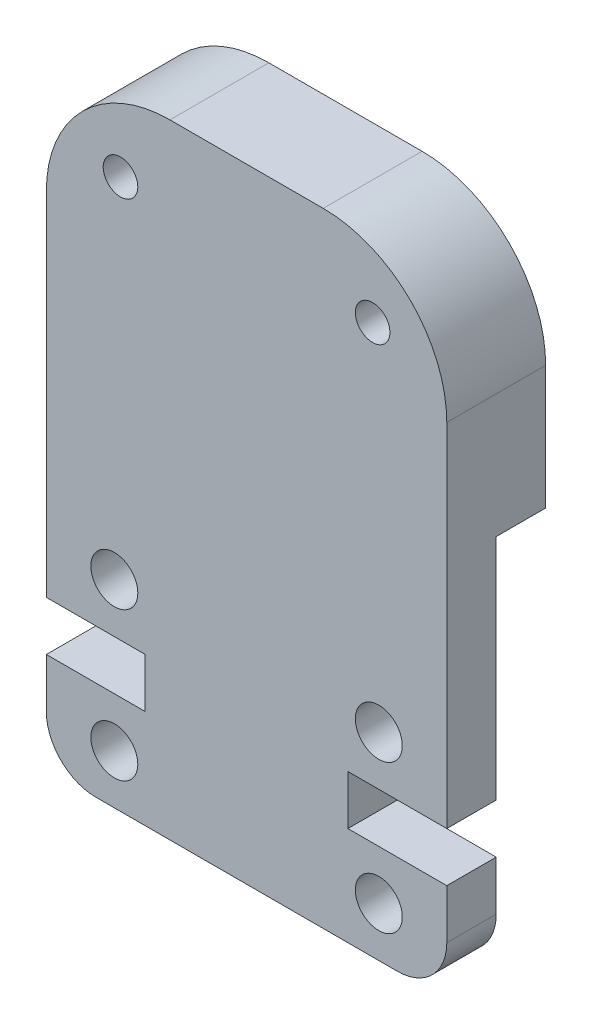
ISO-10303-21;
HEADER;
FILE_DESCRIPTION(('STEP AP214'),'2;1');
FILE_NAME('part.step','',(''),(''),'','','');
FILE_SCHEMA(('AUTOMOTIVE_DESIGN { 1 0 10303 214 1 1 1 1 }'));
ENDSEC;
DATA;
#1=APPLICATION_CONTEXT('core data for automotive mechanical design processes');
#2=APPLICATION_PROTOCOL_DEFINITION('international standard','automotive_design',2000,#1);
#3=PRODUCT_CONTEXT('',#1,'mechanical');
#4=PRODUCT('Part','Part','',(#3));
#5=PRODUCT_RELATED_PRODUCT_CATEGORY('part','',(#4));
#6=PRODUCT_DEFINITION_FORMATION('','',#4);
#7=PRODUCT_DEFINITION_CONTEXT('part definition',#1,'design');
#8=PRODUCT_DEFINITION('design','',#6,#7);
#9=PRODUCT_DEFINITION_SHAPE('','',#8);
#10=(LENGTH_UNIT() NAMED_UNIT(*) SI_UNIT(.MILLI.,.METRE.));
#11=(NAMED_UNIT(*) PLANE_ANGLE_UNIT() SI_UNIT($,.RADIAN.));
#12=(NAMED_UNIT(*) SI_UNIT($,.STERADIAN.) SOLID_ANGLE_UNIT());
#13=UNCERTAINTY_MEASURE_WITH_UNIT(LENGTH_MEASURE(1.E-05),#10,'distance_accuracy_value','');
#14=(GEOMETRIC_REPRESENTATION_CONTEXT(3) GLOBAL_UNCERTAINTY_ASSIGNED_CONTEXT((#13)) GLOBAL_UNIT_ASSIGNED_CONTEXT((#10,
#11,#12)) REPRESENTATION_CONTEXT('',''));
#15=CARTESIAN_POINT('',(0.,0.,0.));
#16=DIRECTION('',(0.,0.,1.));
#17=DIRECTION('',(1.,0.,0.));
#18=AXIS2_PLACEMENT_3D('',#15,#16,#17);
#19=CARTESIAN_POINT('',(14.2,2.00000000000002,0.));
#20=DIRECTION('',(0.,0.,-1.));
#21=DIRECTION('',(-1.,0.,0.));
#22=AXIS2_PLACEMENT_3D('',#19,#20,#21);
#23=PLANE('',#22);
#24=CARTESIAN_POINT('',(13.1999999999968,22.2299999999968,0.));
#25=DIRECTION('',(0.,0.,1.));
#26=DIRECTION('',(-1.,0.,0.));
#27=AXIS2_PLACEMENT_3D('',#24,#25,#26);
#28=CIRCLE('',#27,0.699999999999999);
#29=CARTESIAN_POINT('',(12.4999999999968,22.2299999999968,0.));
#30=VERTEX_POINT('',#29);
#31=EDGE_CURVE('E282',#30,#30,#28,.T.);
#32=ORIENTED_EDGE('',*,*,#31,.T.);
#33=EDGE_LOOP('',(#32));
#34=FACE_BOUND('',#33,.T.);
#35=CARTESIAN_POINT('',(3.00000000000323,22.2299999999968,0.));
#36=DIRECTION('',(0.,0.,1.));
#37=DIRECTION('',(1.,0.,0.));
#38=AXIS2_PLACEMENT_3D('',#35,#36,#37);
#39=CIRCLE('',#38,0.699999999999998);
#40=CARTESIAN_POINT('',(3.70000000000323,22.2299999999968,0.));
#41=VERTEX_POINT('',#40);
#42=EDGE_CURVE('E270',#41,#41,#39,.T.);
#43=ORIENTED_EDGE('',*,*,#42,.T.);
#44=EDGE_LOOP('',(#43));
#45=FACE_BOUND('',#44,.T.);
#46=DIRECTION('',(0.,1.,0.));
#47=VECTOR('',#46,1.);
#48=CARTESIAN_POINT('',(16.2,20.23,0.));
#49=LINE('',#48,#47);
#50=CARTESIAN_POINT('',(16.2,15.23,0.));
#51=VERTEX_POINT('',#50);
#52=CARTESIAN_POINT('',(16.2,20.23,0.));
#53=VERTEX_POINT('',#52);
#54=EDGE_CURVE('E159',#51,#53,#49,.T.);
#55=ORIENTED_EDGE('',*,*,#54,.F.);
#56=DIRECTION('',(-1.,0.,0.));
#57=VECTOR('',#56,1.);
#58=CARTESIAN_POINT('',(16.2,15.23,0.));
#59=LINE('',#58,#57);
#60=CARTESIAN_POINT('',(0.,15.23,0.));
#61=VERTEX_POINT('',#60);
#62=EDGE_CURVE('E231',#51,#61,#59,.T.);
#63=ORIENTED_EDGE('',*,*,#62,.T.);
#64=DIRECTION('',(0.,-1.,0.));
#65=VECTOR('',#64,1.);
#66=CARTESIAN_POINT('',(0.,20.23,0.));
#67=LINE('',#66,#65);
#68=CARTESIAN_POINT('',(0.,20.23,0.));
#69=VERTEX_POINT('',#68);
#70=EDGE_CURVE('E167',#69,#61,#67,.T.);
#71=ORIENTED_EDGE('',*,*,#70,.F.);
#72=CARTESIAN_POINT('',(5.00000000000002,20.23,0.));
#73=DIRECTION('',(0.,0.,1.));
#74=DIRECTION('',(1.,0.,0.));
#75=AXIS2_PLACEMENT_3D('',#72,#73,#74);
#76=CIRCLE('',#75,5.00000000000002);
#77=CARTESIAN_POINT('',(5.00000000000002,25.23,0.));
#78=VERTEX_POINT('',#77);
#79=EDGE_CURVE('E80',#78,#69,#76,.T.);
#80=ORIENTED_EDGE('',*,*,#79,.F.);
#81=DIRECTION('',(-1.,0.,0.));
#82=VECTOR('',#81,1.);
#83=CARTESIAN_POINT('',(5.00000000000002,25.23,0.));
#84=LINE('',#83,#82);
#85=CARTESIAN_POINT('',(11.2,25.23,0.));
#86=VERTEX_POINT('',#85);
#87=EDGE_CURVE('E164',#86,#78,#84,.T.);
#88=ORIENTED_EDGE('',*,*,#87,.F.);
#89=CARTESIAN_POINT('',(11.2,20.23,0.));
#90=DIRECTION('',(0.,0.,1.));
#91=DIRECTION('',(-1.,0.,0.));
#92=AXIS2_PLACEMENT_3D('',#89,#90,#91);
#93=CIRCLE('',#92,5.00000000000002);
#94=EDGE_CURVE('E161',#53,#86,#93,.T.);
#95=ORIENTED_EDGE('',*,*,#94,.F.);
#96=EDGE_LOOP('',(#55,#63,#71,#80,#88,#95));
#97=FACE_BOUND('',#96,.T.);
#98=ADVANCED_FACE('F33',(#34,#45,#97),#23,.T.);
#99=CARTESIAN_POINT('',(16.2,20.23,4.));
#100=DIRECTION('',(-1.,0.,0.));
#101=DIRECTION('',(0.,-1.,0.));
#102=AXIS2_PLACEMENT_3D('',#99,#100,#101);
#103=PLANE('',#102);
#104=DIRECTION('',(0.,0.,-1.));
#105=VECTOR('',#104,1.);
#106=CARTESIAN_POINT('',(16.2,15.23,2.));
#107=LINE('',#106,#105);
#108=CARTESIAN_POINT('',(16.2,15.23,2.));
#109=VERTEX_POINT('',#108);
#110=EDGE_CURVE('E236',#109,#51,#107,.T.);
#111=ORIENTED_EDGE('',*,*,#110,.T.);
#112=ORIENTED_EDGE('',*,*,#54,.T.);
#113=DIRECTION('',(0.,0.,-1.));
#114=VECTOR('',#113,1.);
#115=CARTESIAN_POINT('',(16.2,20.23,4.));
#116=LINE('',#115,#114);
#117=CARTESIAN_POINT('',(16.2,20.23,4.));
#118=VERTEX_POINT('',#117);
#119=EDGE_CURVE('E191',#118,#53,#116,.T.);
#120=ORIENTED_EDGE('',*,*,#119,.F.);
#121=DIRECTION('',(0.,1.,0.));
#122=VECTOR('',#121,1.);
#123=CARTESIAN_POINT('',(16.2,20.23,4.));
#124=LINE('',#123,#122);
#125=CARTESIAN_POINT('',(16.2,6.00000000000006,4.));
#126=VERTEX_POINT('',#125);
#127=EDGE_CURVE('E297',#126,#118,#124,.T.);
#128=ORIENTED_EDGE('',*,*,#127,.F.);
#129=DIRECTION('',(0.,0.,-1.));
#130=VECTOR('',#129,1.);
#131=CARTESIAN_POINT('',(16.2,6.00000000000006,4.));
#132=LINE('',#131,#130);
#133=CARTESIAN_POINT('',(16.2,6.00000000000006,2.));
#134=VERTEX_POINT('',#133);
#135=EDGE_CURVE('E194',#126,#134,#132,.T.);
#136=ORIENTED_EDGE('',*,*,#135,.T.);
#137=DIRECTION('',(0.,1.,0.));
#138=VECTOR('',#137,1.);
#139=CARTESIAN_POINT('',(16.2,0.,2.));
#140=LINE('',#139,#138);
#141=EDGE_CURVE('E221',#134,#109,#140,.T.);
#142=ORIENTED_EDGE('',*,*,#141,.T.);
#143=EDGE_LOOP('',(#111,#112,#120,#128,#136,#142));
#144=FACE_BOUND('',#143,.T.);
#145=ADVANCED_FACE('F379',(#144),#103,.F.);
#146=CARTESIAN_POINT('',(0.,20.23,4.));
#147=DIRECTION('',(1.,0.,0.));
#148=DIRECTION('',(0.,1.,0.));
#149=AXIS2_PLACEMENT_3D('',#146,#147,#148);
#150=PLANE('',#149);
#151=DIRECTION('',(0.,0.,-1.));
#152=VECTOR('',#151,1.);
#153=CARTESIAN_POINT('',(0.,15.23,2.));
#154=LINE('',#153,#152);
#155=CARTESIAN_POINT('',(0.,15.23,2.));
#156=VERTEX_POINT('',#155);
#157=EDGE_CURVE('E224',#156,#61,#154,.T.);
#158=ORIENTED_EDGE('',*,*,#157,.F.);
#159=DIRECTION('',(0.,-1.,0.));
#160=VECTOR('',#159,1.);
#161=CARTESIAN_POINT('',(0.,15.23,2.));
#162=LINE('',#161,#160);
#163=CARTESIAN_POINT('',(0.,6.00000000000004,2.));
#164=VERTEX_POINT('',#163);
#165=EDGE_CURVE('E356',#156,#164,#162,.T.);
#166=ORIENTED_EDGE('',*,*,#165,.T.);
#167=DIRECTION('',(0.,0.,-1.));
#168=VECTOR('',#167,1.);
#169=CARTESIAN_POINT('',(0.,6.00000000000003,4.));
#170=LINE('',#169,#168);
#171=CARTESIAN_POINT('',(0.,6.00000000000003,4.));
#172=VERTEX_POINT('',#171);
#173=EDGE_CURVE('E181',#172,#164,#170,.T.);
#174=ORIENTED_EDGE('',*,*,#173,.F.);
#175=DIRECTION('',(0.,-1.,0.));
#176=VECTOR('',#175,1.);
#177=CARTESIAN_POINT('',(0.,20.23,4.));
#178=LINE('',#177,#176);
#179=CARTESIAN_POINT('',(0.,20.23,4.));
#180=VERTEX_POINT('',#179);
#181=EDGE_CURVE('E305',#180,#172,#178,.T.);
#182=ORIENTED_EDGE('',*,*,#181,.F.);
#183=DIRECTION('',(0.,0.,-1.));
#184=VECTOR('',#183,1.);
#185=CARTESIAN_POINT('',(0.,20.23,4.));
#186=LINE('',#185,#184);
#187=EDGE_CURVE('E184',#180,#69,#186,.T.);
#188=ORIENTED_EDGE('',*,*,#187,.T.);
#189=ORIENTED_EDGE('',*,*,#70,.T.);
#190=EDGE_LOOP('',(#158,#166,#174,#182,#188,#189));
#191=FACE_BOUND('',#190,.T.);
#192=ADVANCED_FACE('F362',(#191),#150,.F.);
#193=CARTESIAN_POINT('',(14.2,2.00000000000002,4.));
#194=DIRECTION('',(0.,0.,-1.));
#195=DIRECTION('',(-1.,0.,0.));
#196=AXIS2_PLACEMENT_3D('',#193,#194,#195);
#197=PLANE('',#196);
#198=CARTESIAN_POINT('',(3.00000000000323,22.2299999999968,4.));
#199=DIRECTION('',(0.,0.,1.));
#200=DIRECTION('',(1.,0.,0.));
#201=AXIS2_PLACEMENT_3D('',#198,#199,#200);
#202=CIRCLE('',#201,0.699999999999998);
#203=CARTESIAN_POINT('',(3.70000000000323,22.2299999999968,4.));
#204=VERTEX_POINT('',#203);
#205=EDGE_CURVE('E271',#204,#204,#202,.T.);
#206=ORIENTED_EDGE('',*,*,#205,.F.);
#207=EDGE_LOOP('',(#206));
#208=FACE_BOUND('',#207,.T.);
#209=CARTESIAN_POINT('',(2.75000000000002,8.00000000000025,4.));
#210=DIRECTION('',(0.,0.,1.));
#211=DIRECTION('',(1.,0.,0.));
#212=AXIS2_PLACEMENT_3D('',#209,#210,#211);
#213=CIRCLE('',#212,0.95);
#214=CARTESIAN_POINT('',(3.70000000000002,8.00000000000025,4.));
#215=VERTEX_POINT('',#214);
#216=EDGE_CURVE('E279',#215,#215,#213,.T.);
#217=ORIENTED_EDGE('',*,*,#216,.F.);
#218=EDGE_LOOP('',(#217));
#219=FACE_BOUND('',#218,.T.);
#220=CARTESIAN_POINT('',(13.45,2.00000000000002,4.));
#221=DIRECTION('',(0.,0.,1.));
#222=DIRECTION('',(-1.,0.,0.));
#223=AXIS2_PLACEMENT_3D('',#220,#221,#222);
#224=CIRCLE('',#223,0.949999999999999);
#225=CARTESIAN_POINT('',(12.5,2.00000000000002,4.));
#226=VERTEX_POINT('',#225);
#227=EDGE_CURVE('E162',#226,#226,#224,.T.);
#228=ORIENTED_EDGE('',*,*,#227,.F.);
#229=EDGE_LOOP('',(#228));
#230=FACE_BOUND('',#229,.T.);
#231=CARTESIAN_POINT('',(14.2,2.00000000000002,4.));
#232=DIRECTION('',(0.,0.,1.));
#233=DIRECTION('',(-1.,0.,0.));
#234=AXIS2_PLACEMENT_3D('',#231,#232,#233);
#235=CIRCLE('',#234,2.00000000000002);
#236=CARTESIAN_POINT('',(14.2,0.,4.));
#237=VERTEX_POINT('',#236);
#238=CARTESIAN_POINT('',(16.2,2.00000000000002,4.));
#239=VERTEX_POINT('',#238);
#240=EDGE_CURVE('E170',#237,#239,#235,.T.);
#241=ORIENTED_EDGE('',*,*,#240,.T.);
#242=DIRECTION('',(0.,1.,0.));
#243=VECTOR('',#242,1.);
#244=CARTESIAN_POINT('',(16.2,2.00000000000002,4.));
#245=LINE('',#244,#243);
#246=CARTESIAN_POINT('',(16.2,4.00000000000001,4.));
#247=VERTEX_POINT('',#246);
#248=EDGE_CURVE('E88',#239,#247,#245,.T.);
#249=ORIENTED_EDGE('',*,*,#248,.T.);
#250=DIRECTION('',(-1.,0.,0.));
#251=VECTOR('',#250,1.);
#252=CARTESIAN_POINT('',(12.1999999999999,4.00000000000003,4.));
#253=LINE('',#252,#251);
#254=CARTESIAN_POINT('',(12.1999999999999,4.00000000000003,4.));
#255=VERTEX_POINT('',#254);
#256=EDGE_CURVE('E212',#247,#255,#253,.T.);
#257=ORIENTED_EDGE('',*,*,#256,.T.);
#258=DIRECTION('',(0.,1.,0.));
#259=VECTOR('',#258,1.);
#260=CARTESIAN_POINT('',(12.1999999999999,6.00000000000006,4.));
#261=LINE('',#260,#259);
#262=CARTESIAN_POINT('',(12.1999999999999,6.00000000000006,4.));
#263=VERTEX_POINT('',#262);
#264=EDGE_CURVE('E293',#255,#263,#261,.T.);
#265=ORIENTED_EDGE('',*,*,#264,.T.);
#266=DIRECTION('',(1.,0.,0.));
#267=VECTOR('',#266,1.);
#268=CARTESIAN_POINT('',(16.2,6.00000000000006,4.));
#269=LINE('',#268,#267);
#270=EDGE_CURVE('E295',#263,#126,#269,.T.);
#271=ORIENTED_EDGE('',*,*,#270,.T.);
#272=ORIENTED_EDGE('',*,*,#127,.T.);
#273=CARTESIAN_POINT('',(11.2,20.23,4.));
#274=DIRECTION('',(0.,0.,1.));
#275=DIRECTION('',(-1.,0.,0.));
#276=AXIS2_PLACEMENT_3D('',#273,#274,#275);
#277=CIRCLE('',#276,5.00000000000002);
#278=CARTESIAN_POINT('',(11.2,25.23,4.));
#279=VERTEX_POINT('',#278);
#280=EDGE_CURVE('E299',#118,#279,#277,.T.);
#281=ORIENTED_EDGE('',*,*,#280,.T.);
#282=DIRECTION('',(-1.,0.,0.));
#283=VECTOR('',#282,1.);
#284=CARTESIAN_POINT('',(5.00000000000002,25.23,4.));
#285=LINE('',#284,#283);
#286=CARTESIAN_POINT('',(5.00000000000002,25.23,4.));
#287=VERTEX_POINT('',#286);
#288=EDGE_CURVE('E301',#279,#287,#285,.T.);
#289=ORIENTED_EDGE('',*,*,#288,.T.);
#290=CARTESIAN_POINT('',(5.00000000000002,20.23,4.));
#291=DIRECTION('',(0.,0.,1.));
#292=DIRECTION('',(1.,0.,0.));
#293=AXIS2_PLACEMENT_3D('',#290,#291,#292);
#294=CIRCLE('',#293,5.00000000000002);
#295=EDGE_CURVE('E303',#287,#180,#294,.T.);
#296=ORIENTED_EDGE('',*,*,#295,.T.);
#297=ORIENTED_EDGE('',*,*,#181,.T.);
#298=DIRECTION('',(1.,0.,0.));
#299=VECTOR('',#298,1.);
#300=CARTESIAN_POINT('',(0.,6.00000000000003,4.));
#301=LINE('',#300,#299);
#302=CARTESIAN_POINT('',(4.00000000000004,6.00000000000003,4.));
#303=VERTEX_POINT('',#302);
#304=EDGE_CURVE('E307',#172,#303,#301,.T.);
#305=ORIENTED_EDGE('',*,*,#304,.T.);
#306=DIRECTION('',(0.,-1.,0.));
#307=VECTOR('',#306,1.);
#308=CARTESIAN_POINT('',(4.00000000000004,6.00000000000003,4.));
#309=LINE('',#308,#307);
#310=CARTESIAN_POINT('',(4.00000000000004,4.00000000000002,4.));
#311=VERTEX_POINT('',#310);
#312=EDGE_CURVE('E309',#303,#311,#309,.T.);
#313=ORIENTED_EDGE('',*,*,#312,.T.);
#314=DIRECTION('',(-1.,0.,0.));
#315=VECTOR('',#314,1.);
#316=CARTESIAN_POINT('',(4.00000000000004,4.00000000000002,4.));
#317=LINE('',#316,#315);
#318=CARTESIAN_POINT('',(0.,4.,4.));
#319=VERTEX_POINT('',#318);
#320=EDGE_CURVE('E135',#311,#319,#317,.T.);
#321=ORIENTED_EDGE('',*,*,#320,.T.);
#322=DIRECTION('',(0.,-1.,0.));
#323=VECTOR('',#322,1.);
#324=CARTESIAN_POINT('',(0.,2.00000000000003,4.));
#325=LINE('',#324,#323);
#326=CARTESIAN_POINT('',(0.,2.00000000000003,4.));
#327=VERTEX_POINT('',#326);
#328=EDGE_CURVE('E127',#319,#327,#325,.T.);
#329=ORIENTED_EDGE('',*,*,#328,.T.);
#330=CARTESIAN_POINT('',(2.00000000000001,2.00000000000003,4.));
#331=DIRECTION('',(0.,0.,1.));
#332=DIRECTION('',(1.,0.,0.));
#333=AXIS2_PLACEMENT_3D('',#330,#331,#332);
#334=CIRCLE('',#333,2.00000000000001);
#335=CARTESIAN_POINT('',(2.00000000000001,0.,4.));
#336=VERTEX_POINT('',#335);
#337=EDGE_CURVE('E132',#327,#336,#334,.T.);
#338=ORIENTED_EDGE('',*,*,#337,.T.);
#339=DIRECTION('',(1.,0.,0.));
#340=VECTOR('',#339,1.);
#341=CARTESIAN_POINT('',(2.00000000000001,0.,4.));
#342=LINE('',#341,#340);
#343=EDGE_CURVE('E58',#336,#237,#342,.T.);
#344=ORIENTED_EDGE('',*,*,#343,.T.);
#345=EDGE_LOOP('',(#241,#249,#257,#265,#271,#272,#281,#289,#296,#297,#305,#313,#321,#329,#338,#344));
#346=FACE_BOUND('',#345,.T.);
#347=CARTESIAN_POINT('',(13.1999999999968,22.2299999999968,4.));
#348=DIRECTION('',(0.,0.,1.));
#349=DIRECTION('',(-1.,0.,0.));
#350=AXIS2_PLACEMENT_3D('',#347,#348,#349);
#351=CIRCLE('',#350,0.699999999999999);
#352=CARTESIAN_POINT('',(12.4999999999968,22.2299999999968,4.));
#353=VERTEX_POINT('',#352);
#354=EDGE_CURVE('E283',#353,#353,#351,.T.);
#355=ORIENTED_EDGE('',*,*,#354,.F.);
#356=EDGE_LOOP('',(#355));
#357=FACE_BOUND('',#356,.T.);
#358=CARTESIAN_POINT('',(13.45,8.00000000000002,4.));
#359=DIRECTION('',(0.,0.,1.));
#360=DIRECTION('',(-1.,0.,0.));
#361=AXIS2_PLACEMENT_3D('',#358,#359,#360);
#362=CIRCLE('',#361,0.949999999999999);
#363=CARTESIAN_POINT('',(12.5,8.00000000000002,4.));
#364=VERTEX_POINT('',#363);
#365=EDGE_CURVE('E274',#364,#364,#362,.T.);
#366=ORIENTED_EDGE('',*,*,#365,.F.);
#367=EDGE_LOOP('',(#366));
#368=FACE_BOUND('',#367,.T.);
#369=CARTESIAN_POINT('',(2.75000000000002,2.00000000000025,4.));
#370=DIRECTION('',(0.,0.,1.));
#371=DIRECTION('',(1.,0.,0.));
#372=AXIS2_PLACEMENT_3D('',#369,#370,#371);
#373=CIRCLE('',#372,0.95);
#374=CARTESIAN_POINT('',(3.70000000000002,2.00000000000025,4.));
#375=VERTEX_POINT('',#374);
#376=EDGE_CURVE('E267',#375,#375,#373,.T.);
#377=ORIENTED_EDGE('',*,*,#376,.F.);
#378=EDGE_LOOP('',(#377));
#379=FACE_BOUND('',#378,.T.);
#380=ADVANCED_FACE('F129',(#208,#219,#230,#346,#357,#368,#379),#197,.F.);
#381=CARTESIAN_POINT('',(14.2,2.00000000000002,4.));
#382=DIRECTION('',(0.,0.,-1.));
#383=DIRECTION('',(-1.,0.,0.));
#384=AXIS2_PLACEMENT_3D('',#381,#382,#383);
#385=CYLINDRICAL_SURFACE('',#384,2.00000000000002);
#386=DIRECTION('',(0.,0.,-1.));
#387=VECTOR('',#386,1.);
#388=CARTESIAN_POINT('',(14.2,0.,4.));
#389=LINE('',#388,#387);
#390=CARTESIAN_POINT('',(14.2,0.,2.));
#391=VERTEX_POINT('',#390);
#392=EDGE_CURVE('E155',#237,#391,#389,.T.);
#393=ORIENTED_EDGE('',*,*,#392,.T.);
#394=CARTESIAN_POINT('',(14.2,2.00000000000002,2.));
#395=DIRECTION('',(0.,0.,1.));
#396=DIRECTION('',(1.,0.,0.));
#397=AXIS2_PLACEMENT_3D('',#394,#395,#396);
#398=CIRCLE('',#397,2.00000000000002);
#399=CARTESIAN_POINT('',(16.2,2.00000000000002,2.));
#400=VERTEX_POINT('',#399);
#401=EDGE_CURVE('E49',#391,#400,#398,.T.);
#402=ORIENTED_EDGE('',*,*,#401,.T.);
#403=DIRECTION('',(0.,0.,-1.));
#404=VECTOR('',#403,1.);
#405=CARTESIAN_POINT('',(16.2,2.00000000000002,4.));
#406=LINE('',#405,#404);
#407=EDGE_CURVE('E11',#239,#400,#406,.T.);
#408=ORIENTED_EDGE('',*,*,#407,.F.);
#409=ORIENTED_EDGE('',*,*,#240,.F.);
#410=EDGE_LOOP('',(#393,#402,#408,#409));
#411=FACE_BOUND('',#410,.T.);
#412=ADVANCED_FACE('F35',(#411),#385,.T.);
#413=CARTESIAN_POINT('',(16.2,2.00000000000002,4.));
#414=DIRECTION('',(-1.,0.,0.));
#415=DIRECTION('',(0.,-1.,0.));
#416=AXIS2_PLACEMENT_3D('',#413,#414,#415);
#417=PLANE('',#416);
#418=ORIENTED_EDGE('',*,*,#407,.T.);
#419=CARTESIAN_POINT('',(16.2,4.00000000000002,2.));
#420=VERTEX_POINT('',#419);
#421=EDGE_CURVE('E218',#400,#420,#140,.T.);
#422=ORIENTED_EDGE('',*,*,#421,.T.);
#423=DIRECTION('',(0.,0.,-1.));
#424=VECTOR('',#423,1.);
#425=CARTESIAN_POINT('',(16.2,4.00000000000001,4.));
#426=LINE('',#425,#424);
#427=EDGE_CURVE('E42',#247,#420,#426,.T.);
#428=ORIENTED_EDGE('',*,*,#427,.F.);
#429=ORIENTED_EDGE('',*,*,#248,.F.);
#430=EDGE_LOOP('',(#418,#422,#428,#429));
#431=FACE_BOUND('',#430,.T.);
#432=ADVANCED_FACE('F217',(#431),#417,.F.);
#433=CARTESIAN_POINT('',(12.1999999999999,4.00000000000003,4.));
#434=DIRECTION('',(0.,-1.,0.));
#435=DIRECTION('',(1.,0.,0.));
#436=AXIS2_PLACEMENT_3D('',#433,#434,#435);
#437=PLANE('',#436);
#438=ORIENTED_EDGE('',*,*,#427,.T.);
#439=DIRECTION('',(-1.,0.,0.));
#440=VECTOR('',#439,1.);
#441=CARTESIAN_POINT('',(12.1999999999999,4.00000000000003,2.));
#442=LINE('',#441,#440);
#443=CARTESIAN_POINT('',(12.1999999999999,4.00000000000003,2.));
#444=VERTEX_POINT('',#443);
#445=EDGE_CURVE('E211',#420,#444,#442,.T.);
#446=ORIENTED_EDGE('',*,*,#445,.T.);
#447=DIRECTION('',(0.,0.,-1.));
#448=VECTOR('',#447,1.);
#449=CARTESIAN_POINT('',(12.1999999999999,4.00000000000003,4.));
#450=LINE('',#449,#448);
#451=EDGE_CURVE('E200',#255,#444,#450,.T.);
#452=ORIENTED_EDGE('',*,*,#451,.F.);
#453=ORIENTED_EDGE('',*,*,#256,.F.);
#454=EDGE_LOOP('',(#438,#446,#452,#453));
#455=FACE_BOUND('',#454,.T.);
#456=ADVANCED_FACE('F208',(#455),#437,.F.);
#457=CARTESIAN_POINT('',(12.1999999999999,6.00000000000006,4.));
#458=DIRECTION('',(-1.,0.,0.));
#459=DIRECTION('',(0.,0.,1.));
#460=AXIS2_PLACEMENT_3D('',#457,#458,#459);
#461=PLANE('',#460);
#462=ORIENTED_EDGE('',*,*,#451,.T.);
#463=DIRECTION('',(0.,1.,0.));
#464=VECTOR('',#463,1.);
#465=CARTESIAN_POINT('',(12.1999999999999,6.00000000000006,2.));
#466=LINE('',#465,#464);
#467=CARTESIAN_POINT('',(12.1999999999999,6.00000000000006,2.));
#468=VERTEX_POINT('',#467);
#469=EDGE_CURVE('E262',#444,#468,#466,.T.);
#470=ORIENTED_EDGE('',*,*,#469,.T.);
#471=DIRECTION('',(0.,0.,-1.));
#472=VECTOR('',#471,1.);
#473=CARTESIAN_POINT('',(12.1999999999999,6.00000000000006,4.));
#474=LINE('',#473,#472);
#475=EDGE_CURVE('E197',#263,#468,#474,.T.);
#476=ORIENTED_EDGE('',*,*,#475,.F.);
#477=ORIENTED_EDGE('',*,*,#264,.F.);
#478=EDGE_LOOP('',(#462,#470,#476,#477));
#479=FACE_BOUND('',#478,.T.);
#480=ADVANCED_FACE('F344',(#479),#461,.F.);
#481=CARTESIAN_POINT('',(16.2,6.00000000000006,4.));
#482=DIRECTION('',(0.,1.,0.));
#483=DIRECTION('',(-1.,0.,0.));
#484=AXIS2_PLACEMENT_3D('',#481,#482,#483);
#485=PLANE('',#484);
#486=ORIENTED_EDGE('',*,*,#475,.T.);
#487=DIRECTION('',(1.,0.,0.));
#488=VECTOR('',#487,1.);
#489=CARTESIAN_POINT('',(16.2,6.00000000000006,2.));
#490=LINE('',#489,#488);
#491=EDGE_CURVE('E259',#468,#134,#490,.T.);
#492=ORIENTED_EDGE('',*,*,#491,.T.);
#493=ORIENTED_EDGE('',*,*,#135,.F.);
#494=ORIENTED_EDGE('',*,*,#270,.F.);
#495=EDGE_LOOP('',(#486,#492,#493,#494));
#496=FACE_BOUND('',#495,.T.);
#497=ADVANCED_FACE('F348',(#496),#485,.F.);
#498=CARTESIAN_POINT('',(11.2,20.23,4.));
#499=DIRECTION('',(0.,0.,-1.));
#500=DIRECTION('',(-1.,0.,0.));
#501=AXIS2_PLACEMENT_3D('',#498,#499,#500);
#502=CYLINDRICAL_SURFACE('',#501,5.00000000000002);
#503=ORIENTED_EDGE('',*,*,#94,.T.);
#504=DIRECTION('',(0.,0.,-1.));
#505=VECTOR('',#504,1.);
#506=CARTESIAN_POINT('',(11.2,25.23,4.));
#507=LINE('',#506,#505);
#508=EDGE_CURVE('E188',#279,#86,#507,.T.);
#509=ORIENTED_EDGE('',*,*,#508,.F.);
#510=ORIENTED_EDGE('',*,*,#280,.F.);
#511=ORIENTED_EDGE('',*,*,#119,.T.);
#512=EDGE_LOOP('',(#503,#509,#510,#511));
#513=FACE_BOUND('',#512,.T.);
#514=ADVANCED_FACE('F538',(#513),#502,.T.);
#515=CARTESIAN_POINT('',(5.00000000000002,25.23,4.));
#516=DIRECTION('',(0.,-1.,0.));
#517=DIRECTION('',(0.,0.,-1.));
#518=AXIS2_PLACEMENT_3D('',#515,#516,#517);
#519=PLANE('',#518);
#520=ORIENTED_EDGE('',*,*,#87,.T.);
#521=DIRECTION('',(0.,0.,-1.));
#522=VECTOR('',#521,1.);
#523=CARTESIAN_POINT('',(5.00000000000002,25.23,4.));
#524=LINE('',#523,#522);
#525=EDGE_CURVE('E186',#287,#78,#524,.T.);
#526=ORIENTED_EDGE('',*,*,#525,.F.);
#527=ORIENTED_EDGE('',*,*,#288,.F.);
#528=ORIENTED_EDGE('',*,*,#508,.T.);
#529=EDGE_LOOP('',(#520,#526,#527,#528));
#530=FACE_BOUND('',#529,.T.);
#531=ADVANCED_FACE('F375',(#530),#519,.F.);
#532=CARTESIAN_POINT('',(5.00000000000002,20.23,4.));
#533=DIRECTION('',(0.,0.,-1.));
#534=DIRECTION('',(-1.,0.,0.));
#535=AXIS2_PLACEMENT_3D('',#532,#533,#534);
#536=CYLINDRICAL_SURFACE('',#535,5.00000000000002);
#537=ORIENTED_EDGE('',*,*,#79,.T.);
#538=ORIENTED_EDGE('',*,*,#187,.F.);
#539=ORIENTED_EDGE('',*,*,#295,.F.);
#540=ORIENTED_EDGE('',*,*,#525,.T.);
#541=EDGE_LOOP('',(#537,#538,#539,#540));
#542=FACE_BOUND('',#541,.T.);
#543=ADVANCED_FACE('F368',(#542),#536,.T.);
#544=CARTESIAN_POINT('',(0.,6.00000000000003,4.));
#545=DIRECTION('',(0.,1.,0.));
#546=DIRECTION('',(0.,0.,1.));
#547=AXIS2_PLACEMENT_3D('',#544,#545,#546);
#548=PLANE('',#547);
#549=ORIENTED_EDGE('',*,*,#173,.T.);
#550=DIRECTION('',(1.,0.,0.));
#551=VECTOR('',#550,1.);
#552=CARTESIAN_POINT('',(0.,6.00000000000003,2.));
#553=LINE('',#552,#551);
#554=CARTESIAN_POINT('',(4.00000000000004,6.00000000000003,2.));
#555=VERTEX_POINT('',#554);
#556=EDGE_CURVE('E256',#164,#555,#553,.T.);
#557=ORIENTED_EDGE('',*,*,#556,.T.);
#558=DIRECTION('',(0.,0.,-1.));
#559=VECTOR('',#558,1.);
#560=CARTESIAN_POINT('',(4.00000000000004,6.00000000000003,4.));
#561=LINE('',#560,#559);
#562=EDGE_CURVE('E178',#303,#555,#561,.T.);
#563=ORIENTED_EDGE('',*,*,#562,.F.);
#564=ORIENTED_EDGE('',*,*,#304,.F.);
#565=EDGE_LOOP('',(#549,#557,#563,#564));
#566=FACE_BOUND('',#565,.T.);
#567=ADVANCED_FACE('F366',(#566),#548,.F.);
#568=CARTESIAN_POINT('',(4.00000000000004,6.00000000000003,4.));
#569=DIRECTION('',(1.,0.,0.));
#570=DIRECTION('',(0.,0.,-1.));
#571=AXIS2_PLACEMENT_3D('',#568,#569,#570);
#572=PLANE('',#571);
#573=ORIENTED_EDGE('',*,*,#562,.T.);
#574=DIRECTION('',(0.,-1.,0.));
#575=VECTOR('',#574,1.);
#576=CARTESIAN_POINT('',(4.00000000000004,6.00000000000003,2.));
#577=LINE('',#576,#575);
#578=CARTESIAN_POINT('',(4.00000000000004,4.00000000000002,2.));
#579=VERTEX_POINT('',#578);
#580=EDGE_CURVE('E253',#555,#579,#577,.T.);
#581=ORIENTED_EDGE('',*,*,#580,.T.);
#582=DIRECTION('',(0.,0.,-1.));
#583=VECTOR('',#582,1.);
#584=CARTESIAN_POINT('',(4.00000000000004,4.00000000000002,4.));
#585=LINE('',#584,#583);
#586=EDGE_CURVE('E175',#311,#579,#585,.T.);
#587=ORIENTED_EDGE('',*,*,#586,.F.);
#588=ORIENTED_EDGE('',*,*,#312,.F.);
#589=EDGE_LOOP('',(#573,#581,#587,#588));
#590=FACE_BOUND('',#589,.T.);
#591=ADVANCED_FACE('F315',(#590),#572,.F.);
#592=CARTESIAN_POINT('',(4.00000000000004,4.00000000000002,4.));
#593=DIRECTION('',(0.,-1.,0.));
#594=DIRECTION('',(1.,0.,0.));
#595=AXIS2_PLACEMENT_3D('',#592,#593,#594);
#596=PLANE('',#595);
#597=ORIENTED_EDGE('',*,*,#586,.T.);
#598=DIRECTION('',(-1.,0.,0.));
#599=VECTOR('',#598,1.);
#600=CARTESIAN_POINT('',(4.00000000000004,4.00000000000002,2.));
#601=LINE('',#600,#599);
#602=CARTESIAN_POINT('',(0.,4.00000000000001,2.));
#603=VERTEX_POINT('',#602);
#604=EDGE_CURVE('E250',#579,#603,#601,.T.);
#605=ORIENTED_EDGE('',*,*,#604,.T.);
#606=DIRECTION('',(0.,0.,-1.));
#607=VECTOR('',#606,1.);
#608=CARTESIAN_POINT('',(0.,4.,4.));
#609=LINE('',#608,#607);
#610=EDGE_CURVE('E149',#319,#603,#609,.T.);
#611=ORIENTED_EDGE('',*,*,#610,.F.);
#612=ORIENTED_EDGE('',*,*,#320,.F.);
#613=EDGE_LOOP('',(#597,#605,#611,#612));
#614=FACE_BOUND('',#613,.T.);
#615=ADVANCED_FACE('F319',(#614),#596,.F.);
#616=CARTESIAN_POINT('',(0.,2.00000000000003,4.));
#617=DIRECTION('',(1.,0.,0.));
#618=DIRECTION('',(0.,0.,-1.));
#619=AXIS2_PLACEMENT_3D('',#616,#617,#618);
#620=PLANE('',#619);
#621=ORIENTED_EDGE('',*,*,#610,.T.);
#622=CARTESIAN_POINT('',(0.,2.00000000000003,2.));
#623=VERTEX_POINT('',#622);
#624=EDGE_CURVE('E146',#603,#623,#162,.T.);
#625=ORIENTED_EDGE('',*,*,#624,.T.);
#626=DIRECTION('',(0.,0.,-1.));
#627=VECTOR('',#626,1.);
#628=CARTESIAN_POINT('',(0.,2.00000000000003,4.));
#629=LINE('',#628,#627);
#630=EDGE_CURVE('E142',#327,#623,#629,.T.);
#631=ORIENTED_EDGE('',*,*,#630,.F.);
#632=ORIENTED_EDGE('',*,*,#328,.F.);
#633=EDGE_LOOP('',(#621,#625,#631,#632));
#634=FACE_BOUND('',#633,.T.);
#635=ADVANCED_FACE('F143',(#634),#620,.F.);
#636=CARTESIAN_POINT('',(2.00000000000001,2.00000000000003,4.));
#637=DIRECTION('',(0.,0.,-1.));
#638=DIRECTION('',(-1.,0.,0.));
#639=AXIS2_PLACEMENT_3D('',#636,#637,#638);
#640=CYLINDRICAL_SURFACE('',#639,2.00000000000001);
#641=ORIENTED_EDGE('',*,*,#630,.T.);
#642=CARTESIAN_POINT('',(2.00000000000001,2.00000000000003,2.));
#643=DIRECTION('',(0.,0.,1.));
#644=DIRECTION('',(1.,0.,0.));
#645=AXIS2_PLACEMENT_3D('',#642,#643,#644);
#646=CIRCLE('',#645,2.00000000000001);
#647=CARTESIAN_POINT('',(2.00000000000001,0.,2.));
#648=VERTEX_POINT('',#647);
#649=EDGE_CURVE('E248',#623,#648,#646,.T.);
#650=ORIENTED_EDGE('',*,*,#649,.T.);
#651=DIRECTION('',(0.,0.,-1.));
#652=VECTOR('',#651,1.);
#653=CARTESIAN_POINT('',(2.00000000000001,0.,4.));
#654=LINE('',#653,#652);
#655=EDGE_CURVE('E150',#336,#648,#654,.T.);
#656=ORIENTED_EDGE('',*,*,#655,.F.);
#657=ORIENTED_EDGE('',*,*,#337,.F.);
#658=EDGE_LOOP('',(#641,#650,#656,#657));
#659=FACE_BOUND('',#658,.T.);
#660=ADVANCED_FACE('F152',(#659),#640,.T.);
#661=CARTESIAN_POINT('',(2.00000000000001,0.,4.));
#662=DIRECTION('',(0.,1.,0.));
#663=DIRECTION('',(-1.,0.,0.));
#664=AXIS2_PLACEMENT_3D('',#661,#662,#663);
#665=PLANE('',#664);
#666=ORIENTED_EDGE('',*,*,#655,.T.);
#667=DIRECTION('',(1.,0.,0.));
#668=VECTOR('',#667,1.);
#669=CARTESIAN_POINT('',(0.,0.,2.));
#670=LINE('',#669,#668);
#671=EDGE_CURVE('E227',#648,#391,#670,.T.);
#672=ORIENTED_EDGE('',*,*,#671,.T.);
#673=ORIENTED_EDGE('',*,*,#392,.F.);
#674=ORIENTED_EDGE('',*,*,#343,.F.);
#675=EDGE_LOOP('',(#666,#672,#673,#674));
#676=FACE_BOUND('',#675,.T.);
#677=ADVANCED_FACE('F355',(#676),#665,.F.);
#678=CARTESIAN_POINT('',(13.45,2.00000000000002,4.));
#679=DIRECTION('',(0.,0.,-1.));
#680=DIRECTION('',(-1.,0.,0.));
#681=AXIS2_PLACEMENT_3D('',#678,#679,#680);
#682=CYLINDRICAL_SURFACE('',#681,0.949999999999999);
#683=CARTESIAN_POINT('',(13.45,2.00000000000002,2.));
#684=DIRECTION('',(0.,0.,1.));
#685=DIRECTION('',(1.,0.,0.));
#686=AXIS2_PLACEMENT_3D('',#683,#684,#685);
#687=CIRCLE('',#686,0.949999999999999);
#688=CARTESIAN_POINT('',(14.4,2.00000000000002,2.));
#689=VERTEX_POINT('',#688);
#690=EDGE_CURVE('E245',#689,#689,#687,.T.);
#691=ORIENTED_EDGE('',*,*,#690,.F.);
#692=EDGE_LOOP('',(#691));
#693=FACE_BOUND('',#692,.T.);
#694=ORIENTED_EDGE('',*,*,#227,.T.);
#695=EDGE_LOOP('',(#694));
#696=FACE_BOUND('',#695,.T.);
#697=ADVANCED_FACE('F393',(#693,#696),#682,.F.);
#698=CARTESIAN_POINT('',(13.1999999999968,22.2299999999968,4.));
#699=DIRECTION('',(0.,0.,-1.));
#700=DIRECTION('',(-1.,0.,0.));
#701=AXIS2_PLACEMENT_3D('',#698,#699,#700);
#702=CYLINDRICAL_SURFACE('',#701,0.699999999999999);
#703=ORIENTED_EDGE('',*,*,#354,.T.);
#704=EDGE_LOOP('',(#703));
#705=FACE_BOUND('',#704,.T.);
#706=ORIENTED_EDGE('',*,*,#31,.F.);
#707=EDGE_LOOP('',(#706));
#708=FACE_BOUND('',#707,.T.);
#709=ADVANCED_FACE('F421',(#705,#708),#702,.F.);
#710=CARTESIAN_POINT('',(2.75000000000002,8.00000000000025,4.));
#711=DIRECTION('',(0.,0.,-1.));
#712=DIRECTION('',(-1.,0.,0.));
#713=AXIS2_PLACEMENT_3D('',#710,#711,#712);
#714=CYLINDRICAL_SURFACE('',#713,0.95);
#715=CARTESIAN_POINT('',(2.75000000000002,8.00000000000025,2.));
#716=DIRECTION('',(0.,0.,1.));
#717=DIRECTION('',(1.,0.,0.));
#718=AXIS2_PLACEMENT_3D('',#715,#716,#717);
#719=CIRCLE('',#718,0.95);
#720=CARTESIAN_POINT('',(3.70000000000002,8.00000000000025,2.));
#721=VERTEX_POINT('',#720);
#722=EDGE_CURVE('E242',#721,#721,#719,.T.);
#723=ORIENTED_EDGE('',*,*,#722,.F.);
#724=EDGE_LOOP('',(#723));
#725=FACE_BOUND('',#724,.T.);
#726=ORIENTED_EDGE('',*,*,#216,.T.);
#727=EDGE_LOOP('',(#726));
#728=FACE_BOUND('',#727,.T.);
#729=ADVANCED_FACE('F429',(#725,#728),#714,.F.);
#730=CARTESIAN_POINT('',(13.45,8.00000000000002,4.));
#731=DIRECTION('',(0.,0.,-1.));
#732=DIRECTION('',(-1.,0.,0.));
#733=AXIS2_PLACEMENT_3D('',#730,#731,#732);
#734=CYLINDRICAL_SURFACE('',#733,0.949999999999999);
#735=CARTESIAN_POINT('',(13.45,8.00000000000002,2.));
#736=DIRECTION('',(0.,0.,1.));
#737=DIRECTION('',(1.,0.,0.));
#738=AXIS2_PLACEMENT_3D('',#735,#736,#737);
#739=CIRCLE('',#738,0.949999999999999);
#740=CARTESIAN_POINT('',(14.4,8.00000000000002,2.));
#741=VERTEX_POINT('',#740);
#742=EDGE_CURVE('E239',#741,#741,#739,.T.);
#743=ORIENTED_EDGE('',*,*,#742,.F.);
#744=EDGE_LOOP('',(#743));
#745=FACE_BOUND('',#744,.T.);
#746=ORIENTED_EDGE('',*,*,#365,.T.);
#747=EDGE_LOOP('',(#746));
#748=FACE_BOUND('',#747,.T.);
#749=ADVANCED_FACE('F438',(#745,#748),#734,.F.);
#750=CARTESIAN_POINT('',(3.00000000000323,22.2299999999968,4.));
#751=DIRECTION('',(0.,0.,-1.));
#752=DIRECTION('',(-1.,0.,0.));
#753=AXIS2_PLACEMENT_3D('',#750,#751,#752);
#754=CYLINDRICAL_SURFACE('',#753,0.699999999999998);
#755=ORIENTED_EDGE('',*,*,#205,.T.);
#756=EDGE_LOOP('',(#755));
#757=FACE_BOUND('',#756,.T.);
#758=ORIENTED_EDGE('',*,*,#42,.F.);
#759=EDGE_LOOP('',(#758));
#760=FACE_BOUND('',#759,.T.);
#761=ADVANCED_FACE('F446',(#757,#760),#754,.F.);
#762=CARTESIAN_POINT('',(2.75000000000002,2.00000000000025,4.));
#763=DIRECTION('',(0.,0.,-1.));
#764=DIRECTION('',(-1.,0.,0.));
#765=AXIS2_PLACEMENT_3D('',#762,#763,#764);
#766=CYLINDRICAL_SURFACE('',#765,0.95);
#767=CARTESIAN_POINT('',(2.75000000000002,2.00000000000025,2.));
#768=DIRECTION('',(0.,0.,1.));
#769=DIRECTION('',(1.,0.,0.));
#770=AXIS2_PLACEMENT_3D('',#767,#768,#769);
#771=CIRCLE('',#770,0.95);
#772=CARTESIAN_POINT('',(3.70000000000002,2.00000000000025,2.));
#773=VERTEX_POINT('',#772);
#774=EDGE_CURVE('E37',#773,#773,#771,.T.);
#775=ORIENTED_EDGE('',*,*,#774,.F.);
#776=EDGE_LOOP('',(#775));
#777=FACE_BOUND('',#776,.T.);
#778=ORIENTED_EDGE('',*,*,#376,.T.);
#779=EDGE_LOOP('',(#778));
#780=FACE_BOUND('',#779,.T.);
#781=ADVANCED_FACE('F454',(#777,#780),#766,.F.);
#782=CARTESIAN_POINT('',(0.,0.,2.));
#783=DIRECTION('',(0.,0.,1.));
#784=DIRECTION('',(1.,0.,0.));
#785=AXIS2_PLACEMENT_3D('',#782,#783,#784);
#786=PLANE('',#785);
#787=ORIENTED_EDGE('',*,*,#690,.T.);
#788=EDGE_LOOP('',(#787));
#789=FACE_BOUND('',#788,.T.);
#790=ORIENTED_EDGE('',*,*,#722,.T.);
#791=EDGE_LOOP('',(#790));
#792=FACE_BOUND('',#791,.T.);
#793=ORIENTED_EDGE('',*,*,#742,.T.);
#794=EDGE_LOOP('',(#793));
#795=FACE_BOUND('',#794,.T.);
#796=ORIENTED_EDGE('',*,*,#774,.T.);
#797=EDGE_LOOP('',(#796));
#798=FACE_BOUND('',#797,.T.);
#799=ORIENTED_EDGE('',*,*,#671,.F.);
#800=ORIENTED_EDGE('',*,*,#649,.F.);
#801=ORIENTED_EDGE('',*,*,#624,.F.);
#802=ORIENTED_EDGE('',*,*,#604,.F.);
#803=ORIENTED_EDGE('',*,*,#580,.F.);
#804=ORIENTED_EDGE('',*,*,#556,.F.);
#805=ORIENTED_EDGE('',*,*,#165,.F.);
#806=DIRECTION('',(-1.,0.,0.));
#807=VECTOR('',#806,1.);
#808=CARTESIAN_POINT('',(16.2,15.23,2.));
#809=LINE('',#808,#807);
#810=EDGE_CURVE('E220',#109,#156,#809,.T.);
#811=ORIENTED_EDGE('',*,*,#810,.F.);
#812=ORIENTED_EDGE('',*,*,#141,.F.);
#813=ORIENTED_EDGE('',*,*,#491,.F.);
#814=ORIENTED_EDGE('',*,*,#469,.F.);
#815=ORIENTED_EDGE('',*,*,#445,.F.);
#816=ORIENTED_EDGE('',*,*,#421,.F.);
#817=ORIENTED_EDGE('',*,*,#401,.F.);
#818=EDGE_LOOP('',(#799,#800,#801,#802,#803,#804,#805,#811,#812,#813,#814,#815,#816,#817));
#819=FACE_BOUND('',#818,.T.);
#820=ADVANCED_FACE('F341',(#789,#792,#795,#798,#819),#786,.F.);
#821=CARTESIAN_POINT('',(16.2,15.23,2.));
#822=DIRECTION('',(0.,-1.,0.));
#823=DIRECTION('',(1.,0.,0.));
#824=AXIS2_PLACEMENT_3D('',#821,#822,#823);
#825=PLANE('',#824);
#826=ORIENTED_EDGE('',*,*,#62,.F.);
#827=ORIENTED_EDGE('',*,*,#110,.F.);
#828=ORIENTED_EDGE('',*,*,#810,.T.);
#829=ORIENTED_EDGE('',*,*,#157,.T.);
#830=EDGE_LOOP('',(#826,#827,#828,#829));
#831=FACE_BOUND('',#830,.T.);
#832=ADVANCED_FACE('F468',(#831),#825,.T.);
#833=CLOSED_SHELL('',(#98,#145,#192,#380,#412,#432,#456,#480,#497,#514,#531,#543,#567,#591,#615,
#635,#660,#677,#697,#709,#729,#749,#761,#781,#820,#832));
#834=MANIFOLD_SOLID_BREP('B2',#833);
#835=ADVANCED_BREP_SHAPE_REPRESENTATION('',(#18,#834),#14);
#836=SHAPE_DEFINITION_REPRESENTATION(#9,#835);
ENDSEC;
END-ISO-10303-21;
